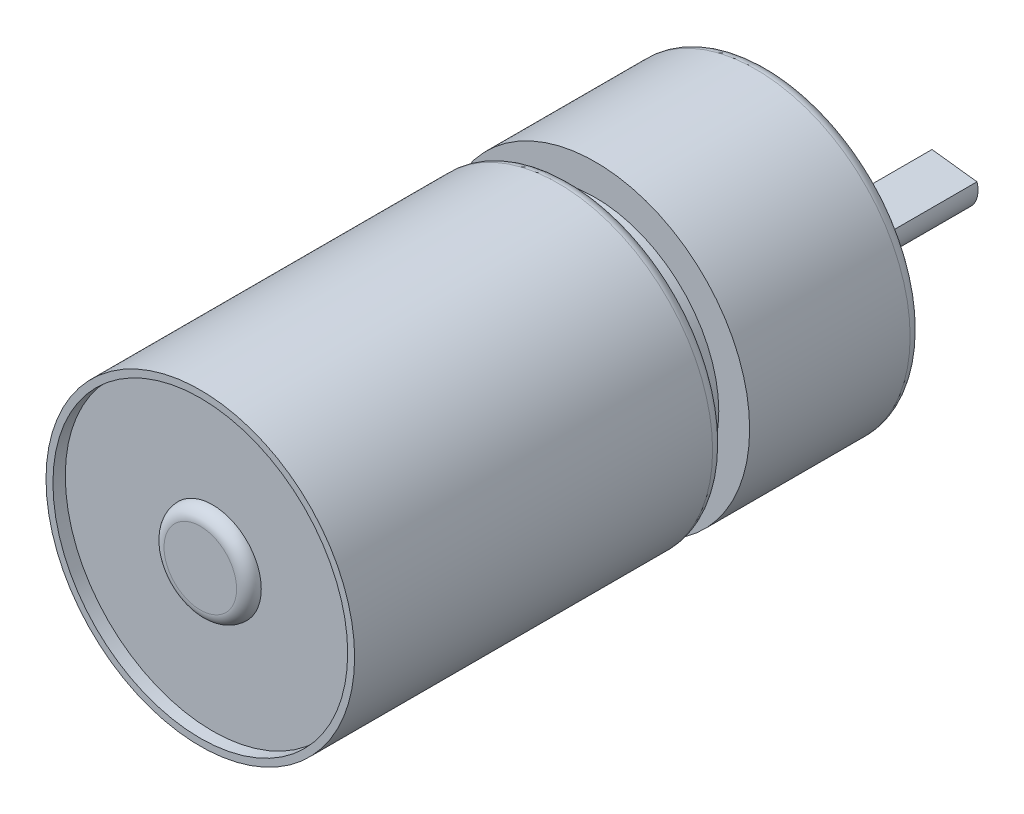
ISO-10303-21;
HEADER;
FILE_DESCRIPTION(('STEP AP214'),'2;1');
FILE_NAME('part.step','',(''),(''),'','','');
FILE_SCHEMA(('AUTOMOTIVE_DESIGN { 1 0 10303 214 1 1 1 1 }'));
ENDSEC;
DATA;
#1=APPLICATION_CONTEXT('core data for automotive mechanical design processes');
#2=APPLICATION_PROTOCOL_DEFINITION('international standard','automotive_design',2000,#1);
#3=PRODUCT_CONTEXT('',#1,'mechanical');
#4=PRODUCT('Part','Part','',(#3));
#5=PRODUCT_RELATED_PRODUCT_CATEGORY('part','',(#4));
#6=PRODUCT_DEFINITION_FORMATION('','',#4);
#7=PRODUCT_DEFINITION_CONTEXT('part definition',#1,'design');
#8=PRODUCT_DEFINITION('design','',#6,#7);
#9=PRODUCT_DEFINITION_SHAPE('','',#8);
#10=(LENGTH_UNIT() NAMED_UNIT(*) SI_UNIT(.MILLI.,.METRE.));
#11=(NAMED_UNIT(*) PLANE_ANGLE_UNIT() SI_UNIT($,.RADIAN.));
#12=(NAMED_UNIT(*) SI_UNIT($,.STERADIAN.) SOLID_ANGLE_UNIT());
#13=UNCERTAINTY_MEASURE_WITH_UNIT(LENGTH_MEASURE(1.E-05),#10,'distance_accuracy_value','');
#14=(GEOMETRIC_REPRESENTATION_CONTEXT(3) GLOBAL_UNCERTAINTY_ASSIGNED_CONTEXT((#13)) GLOBAL_UNIT_ASSIGNED_CONTEXT((#10,
#11,#12)) REPRESENTATION_CONTEXT('',''));
#15=CARTESIAN_POINT('',(0.,0.,0.));
#16=DIRECTION('',(0.,0.,1.));
#17=DIRECTION('',(1.,0.,0.));
#18=AXIS2_PLACEMENT_3D('',#15,#16,#17);
#19=CARTESIAN_POINT('',(0.,0.,14.));
#20=DIRECTION('',(0.,0.,-1.));
#21=DIRECTION('',(-1.,0.,0.));
#22=AXIS2_PLACEMENT_3D('',#19,#20,#21);
#23=CYLINDRICAL_SURFACE('',#22,12.5);
#24=CARTESIAN_POINT('',(0.,0.,0.999999999999999));
#25=DIRECTION('',(0.,0.,1.));
#26=DIRECTION('',(1.,0.,0.));
#27=AXIS2_PLACEMENT_3D('',#24,#25,#26);
#28=CIRCLE('',#27,12.5);
#29=CARTESIAN_POINT('',(12.5,0.,0.999999999999999));
#30=VERTEX_POINT('',#29);
#31=EDGE_CURVE('E145',#30,#30,#28,.T.);
#32=ORIENTED_EDGE('',*,*,#31,.T.);
#33=EDGE_LOOP('',(#32));
#34=FACE_BOUND('',#33,.T.);
#35=CARTESIAN_POINT('',(0.,0.,14.));
#36=DIRECTION('',(0.,0.,1.));
#37=DIRECTION('',(1.,0.,0.));
#38=AXIS2_PLACEMENT_3D('',#35,#36,#37);
#39=CIRCLE('',#38,12.5);
#40=CARTESIAN_POINT('',(12.5,0.,14.));
#41=VERTEX_POINT('',#40);
#42=EDGE_CURVE('E133',#41,#41,#39,.T.);
#43=ORIENTED_EDGE('',*,*,#42,.F.);
#44=EDGE_LOOP('',(#43));
#45=FACE_BOUND('',#44,.T.);
#46=ADVANCED_FACE('F43',(#34,#45),#23,.T.);
#47=CARTESIAN_POINT('',(0.,0.,14.));
#48=DIRECTION('',(0.,0.,1.));
#49=DIRECTION('',(1.,0.,0.));
#50=AXIS2_PLACEMENT_3D('',#47,#48,#49);
#51=PLANE('',#50);
#52=CARTESIAN_POINT('',(0.,0.,14.));
#53=DIRECTION('',(0.,0.,1.));
#54=DIRECTION('',(1.,0.,0.));
#55=AXIS2_PLACEMENT_3D('',#52,#53,#54);
#56=CIRCLE('',#55,10.);
#57=CARTESIAN_POINT('',(10.,0.,14.));
#58=VERTEX_POINT('',#57);
#59=EDGE_CURVE('E134',#58,#58,#56,.T.);
#60=ORIENTED_EDGE('',*,*,#59,.F.);
#61=EDGE_LOOP('',(#60));
#62=FACE_BOUND('',#61,.T.);
#63=ORIENTED_EDGE('',*,*,#42,.T.);
#64=EDGE_LOOP('',(#63));
#65=FACE_BOUND('',#64,.T.);
#66=ADVANCED_FACE('F191',(#62,#65),#51,.T.);
#67=CARTESIAN_POINT('',(0.,0.,0.));
#68=DIRECTION('',(0.,0.,1.));
#69=DIRECTION('',(1.,0.,0.));
#70=AXIS2_PLACEMENT_3D('',#67,#68,#69);
#71=PLANE('',#70);
#72=CARTESIAN_POINT('',(0.,-3.,0.));
#73=DIRECTION('',(0.,0.,1.));
#74=DIRECTION('',(1.,0.,0.));
#75=AXIS2_PLACEMENT_3D('',#72,#73,#74);
#76=CIRCLE('',#75,4.25);
#77=CARTESIAN_POINT('',(4.25,-3.,0.));
#78=VERTEX_POINT('',#77);
#79=EDGE_CURVE('E169',#78,#78,#76,.F.);
#80=ORIENTED_EDGE('',*,*,#79,.F.);
#81=EDGE_LOOP('',(#80));
#82=FACE_BOUND('',#81,.T.);
#83=CARTESIAN_POINT('',(9.49999999999999,0.,0.));
#84=DIRECTION('',(0.,0.,-1.));
#85=DIRECTION('',(-1.,0.,0.));
#86=AXIS2_PLACEMENT_3D('',#83,#84,#85);
#87=CIRCLE('',#86,1.);
#88=CARTESIAN_POINT('',(8.49999999999999,0.,0.));
#89=VERTEX_POINT('',#88);
#90=EDGE_CURVE('E107',#89,#89,#87,.T.);
#91=ORIENTED_EDGE('',*,*,#90,.F.);
#92=EDGE_LOOP('',(#91));
#93=FACE_BOUND('',#92,.T.);
#94=CARTESIAN_POINT('',(-9.5,0.,0.));
#95=DIRECTION('',(0.,0.,-1.));
#96=DIRECTION('',(-1.,0.,0.));
#97=AXIS2_PLACEMENT_3D('',#94,#95,#96);
#98=CIRCLE('',#97,1.);
#99=CARTESIAN_POINT('',(-10.5,0.,0.));
#100=VERTEX_POINT('',#99);
#101=EDGE_CURVE('E111',#100,#100,#98,.T.);
#102=ORIENTED_EDGE('',*,*,#101,.F.);
#103=EDGE_LOOP('',(#102));
#104=FACE_BOUND('',#103,.T.);
#105=CARTESIAN_POINT('',(0.,0.,0.));
#106=DIRECTION('',(0.,0.,1.));
#107=DIRECTION('',(1.,0.,0.));
#108=AXIS2_PLACEMENT_3D('',#105,#106,#107);
#109=CIRCLE('',#108,11.5);
#110=CARTESIAN_POINT('',(11.5,0.,0.));
#111=VERTEX_POINT('',#110);
#112=EDGE_CURVE('E149',#111,#111,#109,.F.);
#113=ORIENTED_EDGE('',*,*,#112,.T.);
#114=EDGE_LOOP('',(#113));
#115=FACE_BOUND('',#114,.T.);
#116=ADVANCED_FACE('F197',(#82,#93,#104,#115),#71,.F.);
#117=CARTESIAN_POINT('',(0.,0.,16.));
#118=DIRECTION('',(0.,0.,-1.));
#119=DIRECTION('',(-1.,0.,0.));
#120=AXIS2_PLACEMENT_3D('',#117,#118,#119);
#121=CYLINDRICAL_SURFACE('',#120,10.);
#122=CARTESIAN_POINT('',(0.,0.,15.));
#123=DIRECTION('',(0.,0.,1.));
#124=DIRECTION('',(1.,0.,0.));
#125=AXIS2_PLACEMENT_3D('',#122,#123,#124);
#126=CIRCLE('',#125,10.);
#127=CARTESIAN_POINT('',(10.,0.,15.));
#128=VERTEX_POINT('',#127);
#129=EDGE_CURVE('E165',#128,#128,#126,.F.);
#130=ORIENTED_EDGE('',*,*,#129,.T.);
#131=EDGE_LOOP('',(#130));
#132=FACE_BOUND('',#131,.T.);
#133=ORIENTED_EDGE('',*,*,#59,.T.);
#134=EDGE_LOOP('',(#133));
#135=FACE_BOUND('',#134,.T.);
#136=ADVANCED_FACE('F248',(#132,#135),#121,.T.);
#137=CARTESIAN_POINT('',(0.,0.,46.));
#138=DIRECTION('',(0.,0.,-1.));
#139=DIRECTION('',(-1.,0.,0.));
#140=AXIS2_PLACEMENT_3D('',#137,#138,#139);
#141=CYLINDRICAL_SURFACE('',#140,12.5);
#142=CARTESIAN_POINT('',(0.,0.,17.));
#143=DIRECTION('',(0.,0.,1.));
#144=DIRECTION('',(1.,0.,0.));
#145=AXIS2_PLACEMENT_3D('',#142,#143,#144);
#146=CIRCLE('',#145,12.5);
#147=CARTESIAN_POINT('',(12.5,0.,17.));
#148=VERTEX_POINT('',#147);
#149=EDGE_CURVE('E153',#148,#148,#146,.T.);
#150=ORIENTED_EDGE('',*,*,#149,.T.);
#151=EDGE_LOOP('',(#150));
#152=FACE_BOUND('',#151,.T.);
#153=CARTESIAN_POINT('',(0.,0.,46.));
#154=DIRECTION('',(0.,0.,1.));
#155=DIRECTION('',(1.,0.,0.));
#156=AXIS2_PLACEMENT_3D('',#153,#154,#155);
#157=CIRCLE('',#156,12.5);
#158=CARTESIAN_POINT('',(12.5,0.,46.));
#159=VERTEX_POINT('',#158);
#160=EDGE_CURVE('E126',#159,#159,#157,.T.);
#161=ORIENTED_EDGE('',*,*,#160,.F.);
#162=EDGE_LOOP('',(#161));
#163=FACE_BOUND('',#162,.T.);
#164=ADVANCED_FACE('F242',(#152,#163),#141,.T.);
#165=CARTESIAN_POINT('',(0.,0.,46.));
#166=DIRECTION('',(0.,0.,1.));
#167=DIRECTION('',(1.,0.,0.));
#168=AXIS2_PLACEMENT_3D('',#165,#166,#167);
#169=PLANE('',#168);
#170=CARTESIAN_POINT('',(0.,0.,46.));
#171=DIRECTION('',(0.,0.,1.));
#172=DIRECTION('',(1.,0.,0.));
#173=AXIS2_PLACEMENT_3D('',#170,#171,#172);
#174=CIRCLE('',#173,11.938790888998);
#175=CARTESIAN_POINT('',(11.938790888998,0.,46.));
#176=VERTEX_POINT('',#175);
#177=EDGE_CURVE('E121',#176,#176,#174,.T.);
#178=ORIENTED_EDGE('',*,*,#177,.F.);
#179=EDGE_LOOP('',(#178));
#180=FACE_BOUND('',#179,.T.);
#181=ORIENTED_EDGE('',*,*,#160,.T.);
#182=EDGE_LOOP('',(#181));
#183=FACE_BOUND('',#182,.T.);
#184=ADVANCED_FACE('F232',(#180,#183),#169,.T.);
#185=CARTESIAN_POINT('',(0.,0.,16.));
#186=DIRECTION('',(0.,0.,1.));
#187=DIRECTION('',(1.,0.,0.));
#188=AXIS2_PLACEMENT_3D('',#185,#186,#187);
#189=PLANE('',#188);
#190=CARTESIAN_POINT('',(0.,0.,16.));
#191=DIRECTION('',(0.,0.,1.));
#192=DIRECTION('',(1.,0.,0.));
#193=AXIS2_PLACEMENT_3D('',#190,#191,#192);
#194=CIRCLE('',#193,11.5);
#195=CARTESIAN_POINT('',(11.5,0.,16.));
#196=VERTEX_POINT('',#195);
#197=EDGE_CURVE('E161',#196,#196,#194,.F.);
#198=ORIENTED_EDGE('',*,*,#197,.T.);
#199=EDGE_LOOP('',(#198));
#200=FACE_BOUND('',#199,.T.);
#201=CARTESIAN_POINT('',(0.,0.,16.));
#202=DIRECTION('',(0.,0.,1.));
#203=DIRECTION('',(1.,0.,0.));
#204=AXIS2_PLACEMENT_3D('',#201,#202,#203);
#205=CIRCLE('',#204,11.);
#206=CARTESIAN_POINT('',(11.,0.,16.));
#207=VERTEX_POINT('',#206);
#208=EDGE_CURVE('E157',#207,#207,#205,.T.);
#209=ORIENTED_EDGE('',*,*,#208,.T.);
#210=EDGE_LOOP('',(#209));
#211=FACE_BOUND('',#210,.T.);
#212=ADVANCED_FACE('F229',(#200,#211),#189,.F.);
#213=CARTESIAN_POINT('',(0.,0.,45.));
#214=DIRECTION('',(0.,0.,1.));
#215=DIRECTION('',(1.,0.,0.));
#216=AXIS2_PLACEMENT_3D('',#213,#214,#215);
#217=CYLINDRICAL_SURFACE('',#216,11.938790888998);
#218=CARTESIAN_POINT('',(0.,0.,45.));
#219=DIRECTION('',(0.,0.,1.));
#220=DIRECTION('',(1.,0.,0.));
#221=AXIS2_PLACEMENT_3D('',#218,#219,#220);
#222=CIRCLE('',#221,11.938790888998);
#223=CARTESIAN_POINT('',(11.938790888998,0.,45.));
#224=VERTEX_POINT('',#223);
#225=EDGE_CURVE('E122',#224,#224,#222,.T.);
#226=ORIENTED_EDGE('',*,*,#225,.F.);
#227=EDGE_LOOP('',(#226));
#228=FACE_BOUND('',#227,.T.);
#229=ORIENTED_EDGE('',*,*,#177,.T.);
#230=EDGE_LOOP('',(#229));
#231=FACE_BOUND('',#230,.T.);
#232=ADVANCED_FACE('F231',(#228,#231),#217,.F.);
#233=CARTESIAN_POINT('',(0.,0.,45.));
#234=DIRECTION('',(0.,0.,1.));
#235=DIRECTION('',(1.,0.,0.));
#236=AXIS2_PLACEMENT_3D('',#233,#234,#235);
#237=PLANE('',#236);
#238=CARTESIAN_POINT('',(0.,0.,45.));
#239=DIRECTION('',(0.,0.,1.));
#240=DIRECTION('',(1.,0.,0.));
#241=AXIS2_PLACEMENT_3D('',#238,#239,#240);
#242=CIRCLE('',#241,3.93894938876642);
#243=CARTESIAN_POINT('',(3.93894938876642,0.,45.));
#244=VERTEX_POINT('',#243);
#245=EDGE_CURVE('E106',#244,#244,#242,.T.);
#246=ORIENTED_EDGE('',*,*,#245,.F.);
#247=EDGE_LOOP('',(#246));
#248=FACE_BOUND('',#247,.T.);
#249=ORIENTED_EDGE('',*,*,#225,.T.);
#250=EDGE_LOOP('',(#249));
#251=FACE_BOUND('',#250,.T.);
#252=ADVANCED_FACE('F239',(#248,#251),#237,.T.);
#253=CARTESIAN_POINT('',(0.,0.,46.));
#254=DIRECTION('',(0.,0.,1.));
#255=DIRECTION('',(1.,0.,0.));
#256=AXIS2_PLACEMENT_3D('',#253,#254,#255);
#257=PLANE('',#256);
#258=CARTESIAN_POINT('',(0.,0.,46.));
#259=DIRECTION('',(0.,0.,1.));
#260=DIRECTION('',(1.,0.,0.));
#261=AXIS2_PLACEMENT_3D('',#258,#259,#260);
#262=CIRCLE('',#261,2.93894938876642);
#263=CARTESIAN_POINT('',(2.93894938876642,0.,46.));
#264=VERTEX_POINT('',#263);
#265=EDGE_CURVE('E138',#264,#264,#262,.T.);
#266=ORIENTED_EDGE('',*,*,#265,.T.);
#267=EDGE_LOOP('',(#266));
#268=FACE_BOUND('',#267,.T.);
#269=ADVANCED_FACE('F207',(#268),#257,.T.);
#270=CARTESIAN_POINT('',(0.,0.,45.));
#271=DIRECTION('',(0.,0.,1.));
#272=DIRECTION('',(1.,0.,0.));
#273=AXIS2_PLACEMENT_3D('',#270,#271,#272);
#274=TOROIDAL_SURFACE('',#273,2.93894938876642,1.);
#275=ORIENTED_EDGE('',*,*,#245,.T.);
#276=EDGE_LOOP('',(#275));
#277=FACE_BOUND('',#276,.T.);
#278=ORIENTED_EDGE('',*,*,#265,.F.);
#279=EDGE_LOOP('',(#278));
#280=FACE_BOUND('',#279,.T.);
#281=ADVANCED_FACE('F203',(#277,#280),#274,.T.);
#282=CARTESIAN_POINT('',(0.,0.,0.999999999999999));
#283=DIRECTION('',(0.,0.,1.));
#284=DIRECTION('',(1.,0.,0.));
#285=AXIS2_PLACEMENT_3D('',#282,#283,#284);
#286=TOROIDAL_SURFACE('',#285,11.5,1.);
#287=ORIENTED_EDGE('',*,*,#112,.F.);
#288=EDGE_LOOP('',(#287));
#289=FACE_BOUND('',#288,.T.);
#290=ORIENTED_EDGE('',*,*,#31,.F.);
#291=EDGE_LOOP('',(#290));
#292=FACE_BOUND('',#291,.T.);
#293=ADVANCED_FACE('F206',(#289,#292),#286,.T.);
#294=CARTESIAN_POINT('',(0.,0.,17.));
#295=DIRECTION('',(0.,0.,1.));
#296=DIRECTION('',(1.,0.,0.));
#297=AXIS2_PLACEMENT_3D('',#294,#295,#296);
#298=TOROIDAL_SURFACE('',#297,11.5,1.);
#299=ORIENTED_EDGE('',*,*,#197,.F.);
#300=EDGE_LOOP('',(#299));
#301=FACE_BOUND('',#300,.T.);
#302=ORIENTED_EDGE('',*,*,#149,.F.);
#303=EDGE_LOOP('',(#302));
#304=FACE_BOUND('',#303,.T.);
#305=ADVANCED_FACE('F211',(#301,#304),#298,.T.);
#306=CARTESIAN_POINT('',(0.,0.,15.));
#307=DIRECTION('',(0.,0.,1.));
#308=DIRECTION('',(1.,0.,0.));
#309=AXIS2_PLACEMENT_3D('',#306,#307,#308);
#310=TOROIDAL_SURFACE('',#309,11.,1.);
#311=ORIENTED_EDGE('',*,*,#129,.F.);
#312=EDGE_LOOP('',(#311));
#313=FACE_BOUND('',#312,.T.);
#314=ORIENTED_EDGE('',*,*,#208,.F.);
#315=EDGE_LOOP('',(#314));
#316=FACE_BOUND('',#315,.T.);
#317=ADVANCED_FACE('F214',(#313,#316),#310,.F.);
#318=CARTESIAN_POINT('',(-9.5,0.,5.));
#319=DIRECTION('',(0.,0.,-1.));
#320=DIRECTION('',(-1.,0.,0.));
#321=AXIS2_PLACEMENT_3D('',#318,#319,#320);
#322=CYLINDRICAL_SURFACE('',#321,1.);
#323=CARTESIAN_POINT('',(-9.5,0.,5.));
#324=DIRECTION('',(0.,0.,-1.));
#325=DIRECTION('',(-1.,0.,0.));
#326=AXIS2_PLACEMENT_3D('',#323,#324,#325);
#327=CIRCLE('',#326,1.);
#328=CARTESIAN_POINT('',(-10.5,0.,5.));
#329=VERTEX_POINT('',#328);
#330=EDGE_CURVE('E98',#329,#329,#327,.T.);
#331=ORIENTED_EDGE('',*,*,#330,.F.);
#332=EDGE_LOOP('',(#331));
#333=FACE_BOUND('',#332,.T.);
#334=ORIENTED_EDGE('',*,*,#101,.T.);
#335=EDGE_LOOP('',(#334));
#336=FACE_BOUND('',#335,.T.);
#337=ADVANCED_FACE('F217',(#333,#336),#322,.F.);
#338=CARTESIAN_POINT('',(-9.5,0.,5.));
#339=DIRECTION('',(0.,0.,-1.));
#340=DIRECTION('',(-1.,0.,0.));
#341=AXIS2_PLACEMENT_3D('',#338,#339,#340);
#342=PLANE('',#341);
#343=ORIENTED_EDGE('',*,*,#330,.T.);
#344=EDGE_LOOP('',(#343));
#345=FACE_BOUND('',#344,.T.);
#346=ADVANCED_FACE('F222',(#345),#342,.T.);
#347=CARTESIAN_POINT('',(9.49999999999999,0.,5.));
#348=DIRECTION('',(0.,0.,-1.));
#349=DIRECTION('',(-1.,0.,0.));
#350=AXIS2_PLACEMENT_3D('',#347,#348,#349);
#351=CYLINDRICAL_SURFACE('',#350,1.);
#352=CARTESIAN_POINT('',(9.49999999999999,0.,5.));
#353=DIRECTION('',(0.,0.,-1.));
#354=DIRECTION('',(-1.,0.,0.));
#355=AXIS2_PLACEMENT_3D('',#352,#353,#354);
#356=CIRCLE('',#355,1.);
#357=CARTESIAN_POINT('',(8.49999999999999,0.,5.));
#358=VERTEX_POINT('',#357);
#359=EDGE_CURVE('E102',#358,#358,#356,.T.);
#360=ORIENTED_EDGE('',*,*,#359,.F.);
#361=EDGE_LOOP('',(#360));
#362=FACE_BOUND('',#361,.T.);
#363=ORIENTED_EDGE('',*,*,#90,.T.);
#364=EDGE_LOOP('',(#363));
#365=FACE_BOUND('',#364,.T.);
#366=ADVANCED_FACE('F273',(#362,#365),#351,.F.);
#367=CARTESIAN_POINT('',(9.49999999999999,0.,5.));
#368=DIRECTION('',(0.,0.,-1.));
#369=DIRECTION('',(-1.,0.,0.));
#370=AXIS2_PLACEMENT_3D('',#367,#368,#369);
#371=PLANE('',#370);
#372=ORIENTED_EDGE('',*,*,#359,.T.);
#373=EDGE_LOOP('',(#372));
#374=FACE_BOUND('',#373,.T.);
#375=ADVANCED_FACE('F275',(#374),#371,.T.);
#376=CARTESIAN_POINT('',(0.,-3.,-3.));
#377=DIRECTION('',(0.,0.,1.));
#378=DIRECTION('',(1.,0.,0.));
#379=AXIS2_PLACEMENT_3D('',#376,#377,#378);
#380=CYLINDRICAL_SURFACE('',#379,4.25);
#381=CARTESIAN_POINT('',(0.,-3.,-2.5));
#382=DIRECTION('',(0.,0.,-1.));
#383=DIRECTION('',(-1.,0.,0.));
#384=AXIS2_PLACEMENT_3D('',#381,#382,#383);
#385=CIRCLE('',#384,4.25);
#386=CARTESIAN_POINT('',(-4.25,-3.,-2.5));
#387=VERTEX_POINT('',#386);
#388=EDGE_CURVE('E11',#387,#387,#385,.F.);
#389=ORIENTED_EDGE('',*,*,#388,.T.);
#390=EDGE_LOOP('',(#389));
#391=FACE_BOUND('',#390,.T.);
#392=ORIENTED_EDGE('',*,*,#79,.T.);
#393=EDGE_LOOP('',(#392));
#394=FACE_BOUND('',#393,.T.);
#395=ADVANCED_FACE('F186',(#391,#394),#380,.T.);
#396=CARTESIAN_POINT('',(0.,-3.,-3.));
#397=DIRECTION('',(0.,0.,-1.));
#398=DIRECTION('',(-1.,0.,0.));
#399=AXIS2_PLACEMENT_3D('',#396,#397,#398);
#400=PLANE('',#399);
#401=CARTESIAN_POINT('',(0.,-3.,-3.));
#402=DIRECTION('',(0.,0.,-1.));
#403=DIRECTION('',(-1.,0.,0.));
#404=AXIS2_PLACEMENT_3D('',#401,#402,#403);
#405=CIRCLE('',#404,2.);
#406=CARTESIAN_POINT('',(-2.,-3.,-3.));
#407=VERTEX_POINT('',#406);
#408=EDGE_CURVE('E94',#407,#407,#405,.T.);
#409=ORIENTED_EDGE('',*,*,#408,.F.);
#410=EDGE_LOOP('',(#409));
#411=FACE_BOUND('',#410,.T.);
#412=CARTESIAN_POINT('',(0.,-3.,-3.));
#413=DIRECTION('',(0.,0.,-1.));
#414=DIRECTION('',(-1.,0.,0.));
#415=AXIS2_PLACEMENT_3D('',#412,#413,#414);
#416=CIRCLE('',#415,3.75);
#417=CARTESIAN_POINT('',(-3.75,-3.,-3.));
#418=VERTEX_POINT('',#417);
#419=EDGE_CURVE('E52',#418,#418,#416,.T.);
#420=ORIENTED_EDGE('',*,*,#419,.T.);
#421=EDGE_LOOP('',(#420));
#422=FACE_BOUND('',#421,.T.);
#423=ADVANCED_FACE('F176',(#411,#422),#400,.T.);
#424=CARTESIAN_POINT('',(0.,-3.,-2.5));
#425=DIRECTION('',(0.,0.,-1.));
#426=DIRECTION('',(-1.,0.,0.));
#427=AXIS2_PLACEMENT_3D('',#424,#425,#426);
#428=TOROIDAL_SURFACE('',#427,3.75,0.5);
#429=ORIENTED_EDGE('',*,*,#388,.F.);
#430=EDGE_LOOP('',(#429));
#431=FACE_BOUND('',#430,.T.);
#432=ORIENTED_EDGE('',*,*,#419,.F.);
#433=EDGE_LOOP('',(#432));
#434=FACE_BOUND('',#433,.T.);
#435=ADVANCED_FACE('F45',(#431,#434),#428,.T.);
#436=CARTESIAN_POINT('',(0.,-3.,-15.));
#437=DIRECTION('',(0.,0.,1.));
#438=DIRECTION('',(1.,0.,0.));
#439=AXIS2_PLACEMENT_3D('',#436,#437,#438);
#440=CYLINDRICAL_SURFACE('',#439,2.);
#441=CARTESIAN_POINT('',(0.,-3.,-15.));
#442=DIRECTION('',(0.,0.,-1.));
#443=DIRECTION('',(-1.,0.,0.));
#444=AXIS2_PLACEMENT_3D('',#441,#442,#443);
#445=CIRCLE('',#444,2.);
#446=CARTESIAN_POINT('',(1.91906623518634,-2.4368083940898,-15.));
#447=VERTEX_POINT('',#446);
#448=CARTESIAN_POINT('',(-1.73196335624444,-1.99984854515604,-15.));
#449=VERTEX_POINT('',#448);
#450=EDGE_CURVE('E75',#447,#449,#445,.T.);
#451=ORIENTED_EDGE('',*,*,#450,.F.);
#452=DIRECTION('',(0.,0.,1.));
#453=VECTOR('',#452,1.);
#454=CARTESIAN_POINT('',(1.91906623518634,-2.4368083940898,-123.131648685362));
#455=LINE('',#454,#453);
#456=CARTESIAN_POINT('',(1.91906623518634,-2.4368083940898,-6.));
#457=VERTEX_POINT('',#456);
#458=EDGE_CURVE('E72',#447,#457,#455,.T.);
#459=ORIENTED_EDGE('',*,*,#458,.T.);
#460=CARTESIAN_POINT('',(0.,-3.,-6.));
#461=DIRECTION('',(0.,0.,-1.));
#462=DIRECTION('',(-1.,0.,0.));
#463=AXIS2_PLACEMENT_3D('',#460,#461,#462);
#464=CIRCLE('',#463,2.);
#465=CARTESIAN_POINT('',(-1.73196335624444,-1.99984854515604,-6.));
#466=VERTEX_POINT('',#465);
#467=EDGE_CURVE('E59',#466,#457,#464,.T.);
#468=ORIENTED_EDGE('',*,*,#467,.F.);
#469=DIRECTION('',(0.,0.,1.));
#470=VECTOR('',#469,1.);
#471=CARTESIAN_POINT('',(-1.73196335624444,-1.99984854515604,-123.131648685362));
#472=LINE('',#471,#470);
#473=EDGE_CURVE('E79',#449,#466,#472,.T.);
#474=ORIENTED_EDGE('',*,*,#473,.F.);
#475=EDGE_LOOP('',(#451,#459,#468,#474));
#476=FACE_BOUND('',#475,.T.);
#477=ORIENTED_EDGE('',*,*,#408,.T.);
#478=EDGE_LOOP('',(#477));
#479=FACE_BOUND('',#478,.T.);
#480=ADVANCED_FACE('F73',(#476,#479),#440,.T.);
#481=CARTESIAN_POINT('',(0.,-3.,-15.));
#482=DIRECTION('',(0.,0.,-1.));
#483=DIRECTION('',(-1.,0.,0.));
#484=AXIS2_PLACEMENT_3D('',#481,#482,#483);
#485=PLANE('',#484);
#486=DIRECTION('',(-0.992914227259568,0.118833233169578,0.));
#487=VECTOR('',#486,1.);
#488=CARTESIAN_POINT('',(1.91906623518634,-2.4368083940898,-15.));
#489=LINE('',#488,#487);
#490=EDGE_CURVE('E66',#447,#449,#489,.T.);
#491=ORIENTED_EDGE('',*,*,#490,.F.);
#492=ORIENTED_EDGE('',*,*,#450,.T.);
#493=EDGE_LOOP('',(#491,#492));
#494=FACE_BOUND('',#493,.T.);
#495=ADVANCED_FACE('F184',(#494),#485,.T.);
#496=CARTESIAN_POINT('',(1.91906623518634,-2.4368083940898,-123.131648685362));
#497=DIRECTION('',(0.118833233169578,0.992914227259568,0.));
#498=DIRECTION('',(-0.992914227259568,0.118833233169578,0.));
#499=AXIS2_PLACEMENT_3D('',#496,#497,#498);
#500=PLANE('',#499);
#501=ORIENTED_EDGE('',*,*,#458,.F.);
#502=ORIENTED_EDGE('',*,*,#490,.T.);
#503=ORIENTED_EDGE('',*,*,#473,.T.);
#504=DIRECTION('',(-0.992914227259568,0.118833233169578,0.));
#505=VECTOR('',#504,1.);
#506=CARTESIAN_POINT('',(1.91906623518634,-2.4368083940898,-6.00000000000001));
#507=LINE('',#506,#505);
#508=EDGE_CURVE('E83',#457,#466,#507,.T.);
#509=ORIENTED_EDGE('',*,*,#508,.F.);
#510=EDGE_LOOP('',(#501,#502,#503,#509));
#511=FACE_BOUND('',#510,.T.);
#512=ADVANCED_FACE('F87',(#511),#500,.T.);
#513=CARTESIAN_POINT('',(0.,-3.,-6.));
#514=DIRECTION('',(0.,0.,-1.));
#515=DIRECTION('',(-1.,0.,0.));
#516=AXIS2_PLACEMENT_3D('',#513,#514,#515);
#517=PLANE('',#516);
#518=ORIENTED_EDGE('',*,*,#508,.T.);
#519=ORIENTED_EDGE('',*,*,#467,.T.);
#520=EDGE_LOOP('',(#518,#519));
#521=FACE_BOUND('',#520,.T.);
#522=ADVANCED_FACE('F82',(#521),#517,.T.);
#523=CLOSED_SHELL('',(#46,#66,#116,#136,#164,#184,#212,#232,#252,#269,#281,#293,#305,#317,#337,
#346,#366,#375,#395,#423,#435,#480,#495,#512,#522));
#524=MANIFOLD_SOLID_BREP('B2',#523);
#525=ADVANCED_BREP_SHAPE_REPRESENTATION('',(#18,#524),#14);
#526=SHAPE_DEFINITION_REPRESENTATION(#9,#525);
ENDSEC;
END-ISO-10303-21;
